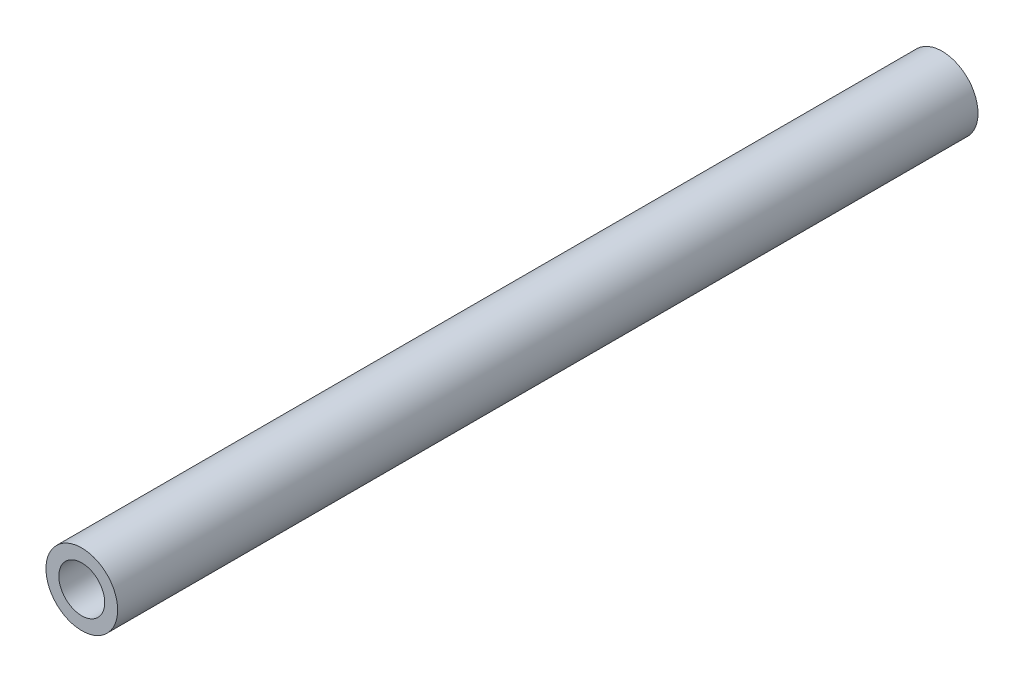
ISO-10303-21;
HEADER;
FILE_DESCRIPTION(('STEP AP214'),'2;1');
FILE_NAME('part.step','',(''),(''),'','','');
FILE_SCHEMA(('AUTOMOTIVE_DESIGN { 1 0 10303 214 1 1 1 1 }'));
ENDSEC;
DATA;
#1=APPLICATION_CONTEXT('core data for automotive mechanical design processes');
#2=APPLICATION_PROTOCOL_DEFINITION('international standard','automotive_design',2000,#1);
#3=PRODUCT_CONTEXT('',#1,'mechanical');
#4=PRODUCT('Part','Part','',(#3));
#5=PRODUCT_RELATED_PRODUCT_CATEGORY('part','',(#4));
#6=PRODUCT_DEFINITION_FORMATION('','',#4);
#7=PRODUCT_DEFINITION_CONTEXT('part definition',#1,'design');
#8=PRODUCT_DEFINITION('design','',#6,#7);
#9=PRODUCT_DEFINITION_SHAPE('','',#8);
#10=(LENGTH_UNIT() NAMED_UNIT(*) SI_UNIT(.MILLI.,.METRE.));
#11=(NAMED_UNIT(*) PLANE_ANGLE_UNIT() SI_UNIT($,.RADIAN.));
#12=(NAMED_UNIT(*) SI_UNIT($,.STERADIAN.) SOLID_ANGLE_UNIT());
#13=UNCERTAINTY_MEASURE_WITH_UNIT(LENGTH_MEASURE(1.E-05),#10,'distance_accuracy_value','');
#14=(GEOMETRIC_REPRESENTATION_CONTEXT(3) GLOBAL_UNCERTAINTY_ASSIGNED_CONTEXT((#13)) GLOBAL_UNIT_ASSIGNED_CONTEXT((#10,
#11,#12)) REPRESENTATION_CONTEXT('',''));
#15=CARTESIAN_POINT('',(0.,0.,0.));
#16=DIRECTION('',(0.,0.,1.));
#17=DIRECTION('',(1.,0.,0.));
#18=AXIS2_PLACEMENT_3D('',#15,#16,#17);
#19=CARTESIAN_POINT('',(0.,0.,60.));
#20=DIRECTION('',(0.,0.,1.));
#21=DIRECTION('',(1.,0.,0.));
#22=AXIS2_PLACEMENT_3D('',#19,#20,#21);
#23=PLANE('',#22);
#24=CARTESIAN_POINT('',(0.,0.,60.));
#25=DIRECTION('',(0.,0.,1.));
#26=DIRECTION('',(1.,0.,0.));
#27=AXIS2_PLACEMENT_3D('',#24,#25,#26);
#28=CIRCLE('',#27,2.5);
#29=CARTESIAN_POINT('',(2.5,0.,60.));
#30=VERTEX_POINT('',#29);
#31=EDGE_CURVE('E10',#30,#30,#28,.T.);
#32=ORIENTED_EDGE('',*,*,#31,.T.);
#33=EDGE_LOOP('',(#32));
#34=FACE_BOUND('',#33,.T.);
#35=CARTESIAN_POINT('',(0.,0.,60.));
#36=DIRECTION('',(0.,0.,1.));
#37=DIRECTION('',(1.,0.,0.));
#38=AXIS2_PLACEMENT_3D('',#35,#36,#37);
#39=CIRCLE('',#38,1.6);
#40=CARTESIAN_POINT('',(1.6,0.,60.));
#41=VERTEX_POINT('',#40);
#42=EDGE_CURVE('E42',#41,#41,#39,.T.);
#43=ORIENTED_EDGE('',*,*,#42,.F.);
#44=EDGE_LOOP('',(#43));
#45=FACE_BOUND('',#44,.T.);
#46=ADVANCED_FACE('F31',(#34,#45),#23,.T.);
#47=CARTESIAN_POINT('',(0.,0.,0.));
#48=DIRECTION('',(0.,0.,1.));
#49=DIRECTION('',(1.,0.,0.));
#50=AXIS2_PLACEMENT_3D('',#47,#48,#49);
#51=PLANE('',#50);
#52=CARTESIAN_POINT('',(0.,0.,0.));
#53=DIRECTION('',(0.,0.,1.));
#54=DIRECTION('',(1.,0.,0.));
#55=AXIS2_PLACEMENT_3D('',#52,#53,#54);
#56=CIRCLE('',#55,2.5);
#57=CARTESIAN_POINT('',(2.5,0.,0.));
#58=VERTEX_POINT('',#57);
#59=EDGE_CURVE('E35',#58,#58,#56,.T.);
#60=ORIENTED_EDGE('',*,*,#59,.F.);
#61=EDGE_LOOP('',(#60));
#62=FACE_BOUND('',#61,.T.);
#63=CARTESIAN_POINT('',(0.,0.,0.));
#64=DIRECTION('',(0.,0.,1.));
#65=DIRECTION('',(1.,0.,0.));
#66=AXIS2_PLACEMENT_3D('',#63,#64,#65);
#67=CIRCLE('',#66,1.6);
#68=CARTESIAN_POINT('',(1.6,0.,0.));
#69=VERTEX_POINT('',#68);
#70=EDGE_CURVE('E44',#69,#69,#67,.T.);
#71=ORIENTED_EDGE('',*,*,#70,.T.);
#72=EDGE_LOOP('',(#71));
#73=FACE_BOUND('',#72,.T.);
#74=ADVANCED_FACE('F54',(#62,#73),#51,.F.);
#75=CARTESIAN_POINT('',(0.,0.,60.));
#76=DIRECTION('',(0.,0.,-1.));
#77=DIRECTION('',(-1.,0.,0.));
#78=AXIS2_PLACEMENT_3D('',#75,#76,#77);
#79=CYLINDRICAL_SURFACE('',#78,2.5);
#80=ORIENTED_EDGE('',*,*,#31,.F.);
#81=EDGE_LOOP('',(#80));
#82=FACE_BOUND('',#81,.T.);
#83=ORIENTED_EDGE('',*,*,#59,.T.);
#84=EDGE_LOOP('',(#83));
#85=FACE_BOUND('',#84,.T.);
#86=ADVANCED_FACE('F33',(#82,#85),#79,.T.);
#87=CARTESIAN_POINT('',(0.,0.,60.));
#88=DIRECTION('',(0.,0.,-1.));
#89=DIRECTION('',(-1.,0.,0.));
#90=AXIS2_PLACEMENT_3D('',#87,#88,#89);
#91=CYLINDRICAL_SURFACE('',#90,1.6);
#92=ORIENTED_EDGE('',*,*,#42,.T.);
#93=EDGE_LOOP('',(#92));
#94=FACE_BOUND('',#93,.T.);
#95=ORIENTED_EDGE('',*,*,#70,.F.);
#96=EDGE_LOOP('',(#95));
#97=FACE_BOUND('',#96,.T.);
#98=ADVANCED_FACE('F50',(#94,#97),#91,.F.);
#99=CLOSED_SHELL('',(#46,#74,#86,#98));
#100=MANIFOLD_SOLID_BREP('B2',#99);
#101=ADVANCED_BREP_SHAPE_REPRESENTATION('',(#18,#100),#14);
#102=SHAPE_DEFINITION_REPRESENTATION(#9,#101);
ENDSEC;
END-ISO-10303-21;
